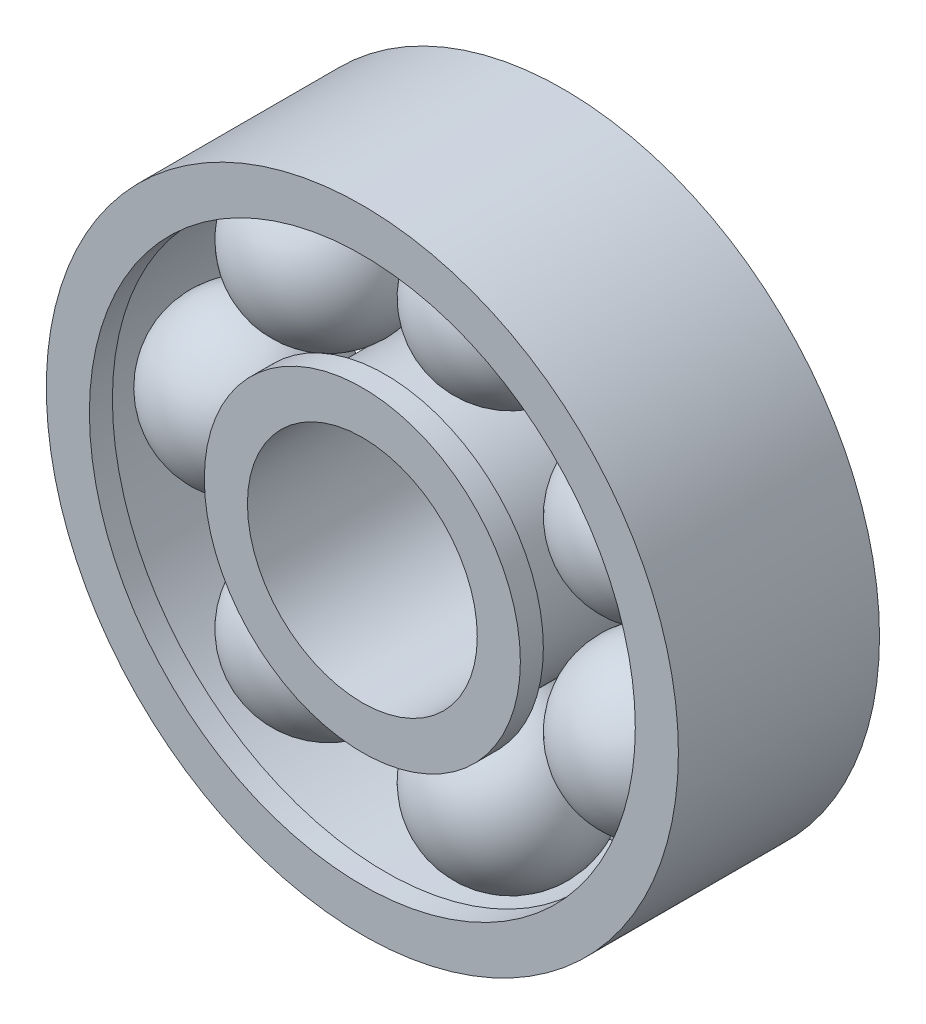
ISO-10303-21;
HEADER;
FILE_DESCRIPTION(('STEP AP214'),'2;1');
FILE_NAME('part.step','',(''),(''),'','','');
FILE_SCHEMA(('AUTOMOTIVE_DESIGN { 1 0 10303 214 1 1 1 1 }'));
ENDSEC;
DATA;
#1=APPLICATION_CONTEXT('core data for automotive mechanical design processes');
#2=APPLICATION_PROTOCOL_DEFINITION('international standard','automotive_design',2000,#1);
#3=PRODUCT_CONTEXT('',#1,'mechanical');
#4=PRODUCT('Part','Part','',(#3));
#5=PRODUCT_RELATED_PRODUCT_CATEGORY('part','',(#4));
#6=PRODUCT_DEFINITION_FORMATION('','',#4);
#7=PRODUCT_DEFINITION_CONTEXT('part definition',#1,'design');
#8=PRODUCT_DEFINITION('design','',#6,#7);
#9=PRODUCT_DEFINITION_SHAPE('','',#8);
#10=(LENGTH_UNIT() NAMED_UNIT(*) SI_UNIT(.MILLI.,.METRE.));
#11=(NAMED_UNIT(*) PLANE_ANGLE_UNIT() SI_UNIT($,.RADIAN.));
#12=(NAMED_UNIT(*) SI_UNIT($,.STERADIAN.) SOLID_ANGLE_UNIT());
#13=UNCERTAINTY_MEASURE_WITH_UNIT(LENGTH_MEASURE(1.E-05),#10,'distance_accuracy_value','');
#14=(GEOMETRIC_REPRESENTATION_CONTEXT(3) GLOBAL_UNCERTAINTY_ASSIGNED_CONTEXT((#13)) GLOBAL_UNIT_ASSIGNED_CONTEXT((#10,
#11,#12)) REPRESENTATION_CONTEXT('',''));
#15=CARTESIAN_POINT('',(0.,0.,0.));
#16=DIRECTION('',(0.,0.,1.));
#17=DIRECTION('',(1.,0.,0.));
#18=AXIS2_PLACEMENT_3D('',#15,#16,#17);
#19=CARTESIAN_POINT('',(-4.67544816414225,-5.86282655863214,0.));
#20=DIRECTION('',(0.781831482468023,-0.623489801858743,0.));
#21=DIRECTION('',(-0.623489801858743,-0.781831482468023,0.));
#22=AXIS2_PLACEMENT_3D('',#19,#20,#21);
#23=SPHERICAL_SURFACE('',#22,2.8);
#24=CARTESIAN_POINT('',(-2.48632001323179,-7.60859800383661,0.));
#25=VERTEX_POINT('',#24);
#26=VERTEX_LOOP('',#25);
#27=FACE_BOUND('',#26,.T.);
#28=ADVANCED_FACE('F56',(#27),#23,.T.);
#29=CLOSED_SHELL('',(#28));
#30=MANIFOLD_SOLID_BREP('B2',#29);
#31=CARTESIAN_POINT('',(1.66864813032649,-7.31082513874743,0.));
#32=DIRECTION('',(-0.974927912181826,-0.222520933956304,0.));
#33=DIRECTION('',(0.222520933956304,-0.974927912181826,0.));
#34=AXIS2_PLACEMENT_3D('',#31,#32,#33);
#35=SPHERICAL_SURFACE('',#34,2.8);
#36=CARTESIAN_POINT('',(-1.06115002378262,-7.93388375382508,0.));
#37=VERTEX_POINT('',#36);
#38=VERTEX_LOOP('',#37);
#39=FACE_BOUND('',#38,.T.);
#40=ADVANCED_FACE('F75',(#39),#35,.T.);
#41=CLOSED_SHELL('',(#40));
#42=MANIFOLD_SOLID_BREP('B7',#41);
#43=CARTESIAN_POINT('',(6.75621834844066,-3.25362327573081,0.));
#44=DIRECTION('',(-0.433883739117566,-0.900968867902415,0.));
#45=DIRECTION('',(-0.900968867902415,0.433883739117566,0.));
#46=AXIS2_PLACEMENT_3D('',#43,#44,#45);
#47=SPHERICAL_SURFACE('',#46,2.8);
#48=CARTESIAN_POINT('',(5.54134387891147,-5.77633610585757,0.));
#49=VERTEX_POINT('',#48);
#50=VERTEX_LOOP('',#49);
#51=FACE_BOUND('',#50,.T.);
#52=ADVANCED_FACE('F94',(#51),#47,.T.);
#53=CLOSED_SHELL('',(#52));
#54=MANIFOLD_SOLID_BREP('B52',#53);
#55=CARTESIAN_POINT('',(6.7562183484407,3.25362327573071,0.));
#56=DIRECTION('',(0.433883739117552,-0.900968867902422,0.));
#57=DIRECTION('',(0.900968867902422,0.433883739117552,0.));
#58=AXIS2_PLACEMENT_3D('',#55,#56,#57);
#59=SPHERICAL_SURFACE('',#58,2.8);
#60=CARTESIAN_POINT('',(7.97109281796985,0.73091044560393,0.));
#61=VERTEX_POINT('',#60);
#62=VERTEX_LOOP('',#61);
#63=FACE_BOUND('',#62,.T.);
#64=ADVANCED_FACE('F113',(#63),#59,.T.);
#65=CLOSED_SHELL('',(#64));
#66=MANIFOLD_SOLID_BREP('B71',#65);
#67=CARTESIAN_POINT('',(1.66864813032659,7.31082513874741,0.));
#68=DIRECTION('',(-0.974927912181823,0.222520933956318,0.));
#69=DIRECTION('',(0.222520933956318,0.974927912181823,0.));
#70=AXIS2_PLACEMENT_3D('',#67,#68,#69);
#71=SPHERICAL_SURFACE('',#70,2.8);
#72=CARTESIAN_POINT('',(-1.06115002378252,7.9338837538251,0.));
#73=VERTEX_POINT('',#72);
#74=VERTEX_LOOP('',#73);
#75=FACE_BOUND('',#74,.T.);
#76=ADVANCED_FACE('F132',(#75),#71,.T.);
#77=CLOSED_SHELL('',(#76));
#78=MANIFOLD_SOLID_BREP('B90',#77);
#79=CARTESIAN_POINT('',(-4.67544816414217,5.8628265586322,0.));
#80=DIRECTION('',(-0.78183148246803,-0.623489801858733,0.));
#81=DIRECTION('',(-0.623489801858733,0.78183148246803,0.));
#82=AXIS2_PLACEMENT_3D('',#79,#80,#81);
#83=SPHERICAL_SURFACE('',#82,2.8);
#84=CARTESIAN_POINT('',(-6.86457631505265,4.11705511342775,0.));
#85=VERTEX_POINT('',#84);
#86=VERTEX_LOOP('',#85);
#87=FACE_BOUND('',#86,.T.);
#88=ADVANCED_FACE('F151',(#87),#83,.T.);
#89=CLOSED_SHELL('',(#88));
#90=MANIFOLD_SOLID_BREP('B109',#89);
#91=CARTESIAN_POINT('',(-7.49883662925013,0.,0.));
#92=DIRECTION('',(0.,-1.,0.));
#93=DIRECTION('',(-1.,0.,0.));
#94=AXIS2_PLACEMENT_3D('',#91,#92,#93);
#95=SPHERICAL_SURFACE('',#94,2.8);
#96=CARTESIAN_POINT('',(-7.49883662925013,-2.8,0.));
#97=VERTEX_POINT('',#96);
#98=VERTEX_LOOP('',#97);
#99=FACE_BOUND('',#98,.T.);
#100=ADVANCED_FACE('F172',(#99),#95,.T.);
#101=CLOSED_SHELL('',(#100));
#102=MANIFOLD_SOLID_BREP('B128',#101);
#103=CARTESIAN_POINT('',(0.,0.,-3.5));
#104=DIRECTION('',(0.,0.,1.));
#105=DIRECTION('',(1.,0.,0.));
#106=AXIS2_PLACEMENT_3D('',#103,#104,#105);
#107=CYLINDRICAL_SURFACE('',#106,5.5);
#108=CARTESIAN_POINT('',(0.,0.,-3.5));
#109=DIRECTION('',(0.,0.,1.));
#110=DIRECTION('',(1.,0.,0.));
#111=AXIS2_PLACEMENT_3D('',#108,#109,#110);
#112=CIRCLE('',#111,5.5);
#113=CARTESIAN_POINT('',(5.5,0.,-3.5));
#114=VERTEX_POINT('',#113);
#115=EDGE_CURVE('E171',#114,#114,#112,.T.);
#116=ORIENTED_EDGE('',*,*,#115,.T.);
#117=EDGE_LOOP('',(#116));
#118=FACE_BOUND('',#117,.T.);
#119=CARTESIAN_POINT('',(0.,0.,-2.7));
#120=DIRECTION('',(0.,0.,1.));
#121=DIRECTION('',(1.,0.,0.));
#122=AXIS2_PLACEMENT_3D('',#119,#120,#121);
#123=CIRCLE('',#122,5.5);
#124=CARTESIAN_POINT('',(5.5,0.,-2.7));
#125=VERTEX_POINT('',#124);
#126=EDGE_CURVE('E208',#125,#125,#123,.F.);
#127=ORIENTED_EDGE('',*,*,#126,.T.);
#128=EDGE_LOOP('',(#127));
#129=FACE_BOUND('',#128,.T.);
#130=ADVANCED_FACE('F192',(#118,#129),#107,.T.);
#131=CARTESIAN_POINT('',(0.,0.,-3.5));
#132=DIRECTION('',(0.,0.,1.));
#133=DIRECTION('',(1.,0.,0.));
#134=AXIS2_PLACEMENT_3D('',#131,#132,#133);
#135=CYLINDRICAL_SURFACE('',#134,4.);
#136=CARTESIAN_POINT('',(0.,0.,-3.5));
#137=DIRECTION('',(0.,0.,1.));
#138=DIRECTION('',(1.,0.,0.));
#139=AXIS2_PLACEMENT_3D('',#136,#137,#138);
#140=CIRCLE('',#139,4.);
#141=CARTESIAN_POINT('',(4.,0.,-3.5));
#142=VERTEX_POINT('',#141);
#143=EDGE_CURVE('E200',#142,#142,#140,.T.);
#144=ORIENTED_EDGE('',*,*,#143,.F.);
#145=EDGE_LOOP('',(#144));
#146=FACE_BOUND('',#145,.T.);
#147=CARTESIAN_POINT('',(0.,0.,3.5));
#148=DIRECTION('',(0.,0.,1.));
#149=DIRECTION('',(1.,0.,0.));
#150=AXIS2_PLACEMENT_3D('',#147,#148,#149);
#151=CIRCLE('',#150,4.);
#152=CARTESIAN_POINT('',(4.,0.,3.5));
#153=VERTEX_POINT('',#152);
#154=EDGE_CURVE('E214',#153,#153,#151,.T.);
#155=ORIENTED_EDGE('',*,*,#154,.T.);
#156=EDGE_LOOP('',(#155));
#157=FACE_BOUND('',#156,.T.);
#158=ADVANCED_FACE('F194',(#146,#157),#135,.F.);
#159=CARTESIAN_POINT('',(0.,0.,2.7));
#160=DIRECTION('',(0.,0.,1.));
#161=DIRECTION('',(1.,0.,0.));
#162=AXIS2_PLACEMENT_3D('',#159,#160,#161);
#163=CIRCLE('',#162,5.5);
#164=CARTESIAN_POINT('',(5.5,0.,2.7));
#165=VERTEX_POINT('',#164);
#166=EDGE_CURVE('E196',#165,#165,#163,.F.);
#167=ORIENTED_EDGE('',*,*,#166,.F.);
#168=EDGE_LOOP('',(#167));
#169=FACE_BOUND('',#168,.T.);
#170=CARTESIAN_POINT('',(0.,0.,3.5));
#171=DIRECTION('',(0.,0.,1.));
#172=DIRECTION('',(1.,0.,0.));
#173=AXIS2_PLACEMENT_3D('',#170,#171,#172);
#174=CIRCLE('',#173,5.5);
#175=CARTESIAN_POINT('',(5.5,0.,3.5));
#176=VERTEX_POINT('',#175);
#177=EDGE_CURVE('E205',#176,#176,#174,.T.);
#178=ORIENTED_EDGE('',*,*,#177,.F.);
#179=EDGE_LOOP('',(#178));
#180=FACE_BOUND('',#179,.T.);
#181=ADVANCED_FACE('F229',(#169,#180),#107,.T.);
#182=CARTESIAN_POINT('',(0.,0.,-3.5));
#183=DIRECTION('',(0.,0.,1.));
#184=DIRECTION('',(1.,0.,0.));
#185=AXIS2_PLACEMENT_3D('',#182,#183,#184);
#186=PLANE('',#185);
#187=ORIENTED_EDGE('',*,*,#143,.T.);
#188=EDGE_LOOP('',(#187));
#189=FACE_BOUND('',#188,.T.);
#190=ORIENTED_EDGE('',*,*,#115,.F.);
#191=EDGE_LOOP('',(#190));
#192=FACE_BOUND('',#191,.T.);
#193=ADVANCED_FACE('F231',(#189,#192),#186,.F.);
#194=CARTESIAN_POINT('',(0.,0.,3.5));
#195=DIRECTION('',(0.,0.,1.));
#196=DIRECTION('',(1.,0.,0.));
#197=AXIS2_PLACEMENT_3D('',#194,#195,#196);
#198=PLANE('',#197);
#199=ORIENTED_EDGE('',*,*,#154,.F.);
#200=EDGE_LOOP('',(#199));
#201=FACE_BOUND('',#200,.T.);
#202=ORIENTED_EDGE('',*,*,#177,.T.);
#203=EDGE_LOOP('',(#202));
#204=FACE_BOUND('',#203,.T.);
#205=ADVANCED_FACE('F227',(#201,#204),#198,.T.);
#206=CARTESIAN_POINT('',(0.,0.,2.7));
#207=DIRECTION('',(0.,0.,1.));
#208=DIRECTION('',(1.,0.,0.));
#209=AXIS2_PLACEMENT_3D('',#206,#207,#208);
#210=PLANE('',#209);
#211=ORIENTED_EDGE('',*,*,#166,.T.);
#212=EDGE_LOOP('',(#211));
#213=FACE_BOUND('',#212,.T.);
#214=CARTESIAN_POINT('',(0.,0.,2.7));
#215=DIRECTION('',(0.,0.,1.));
#216=DIRECTION('',(1.,0.,0.));
#217=AXIS2_PLACEMENT_3D('',#214,#215,#216);
#218=CIRCLE('',#217,4.69767325850026);
#219=CARTESIAN_POINT('',(4.69767325850026,0.,2.7));
#220=VERTEX_POINT('',#219);
#221=EDGE_CURVE('E210',#220,#220,#218,.T.);
#222=ORIENTED_EDGE('',*,*,#221,.T.);
#223=EDGE_LOOP('',(#222));
#224=FACE_BOUND('',#223,.T.);
#225=ADVANCED_FACE('F252',(#213,#224),#210,.F.);
#226=CARTESIAN_POINT('',(0.,0.,2.7));
#227=DIRECTION('',(0.,0.,-1.));
#228=DIRECTION('',(-1.,0.,0.));
#229=AXIS2_PLACEMENT_3D('',#226,#227,#228);
#230=CYLINDRICAL_SURFACE('',#229,4.69767325850026);
#231=ORIENTED_EDGE('',*,*,#221,.F.);
#232=EDGE_LOOP('',(#231));
#233=FACE_BOUND('',#232,.T.);
#234=CARTESIAN_POINT('',(0.,0.,-2.7));
#235=DIRECTION('',(0.,0.,1.));
#236=DIRECTION('',(1.,0.,0.));
#237=AXIS2_PLACEMENT_3D('',#234,#235,#236);
#238=CIRCLE('',#237,4.69767325850026);
#239=CARTESIAN_POINT('',(4.69767325850026,0.,-2.7));
#240=VERTEX_POINT('',#239);
#241=EDGE_CURVE('E216',#240,#240,#238,.T.);
#242=ORIENTED_EDGE('',*,*,#241,.T.);
#243=EDGE_LOOP('',(#242));
#244=FACE_BOUND('',#243,.T.);
#245=ADVANCED_FACE('F280',(#233,#244),#230,.T.);
#246=CARTESIAN_POINT('',(0.,0.,-2.7));
#247=DIRECTION('',(0.,0.,1.));
#248=DIRECTION('',(1.,0.,0.));
#249=AXIS2_PLACEMENT_3D('',#246,#247,#248);
#250=PLANE('',#249);
#251=ORIENTED_EDGE('',*,*,#126,.F.);
#252=EDGE_LOOP('',(#251));
#253=FACE_BOUND('',#252,.T.);
#254=ORIENTED_EDGE('',*,*,#241,.F.);
#255=EDGE_LOOP('',(#254));
#256=FACE_BOUND('',#255,.T.);
#257=ADVANCED_FACE('F290',(#253,#256),#250,.T.);
#258=CLOSED_SHELL('',(#130,#158,#181,#193,#205,#225,#245,#257));
#259=MANIFOLD_SOLID_BREP('B147',#258);
#260=CARTESIAN_POINT('',(0.,0.,-3.5));
#261=DIRECTION('',(0.,0.,1.));
#262=DIRECTION('',(1.,0.,0.));
#263=AXIS2_PLACEMENT_3D('',#260,#261,#262);
#264=CYLINDRICAL_SURFACE('',#263,9.5);
#265=CARTESIAN_POINT('',(0.,0.,-3.5));
#266=DIRECTION('',(0.,0.,1.));
#267=DIRECTION('',(1.,0.,0.));
#268=AXIS2_PLACEMENT_3D('',#265,#266,#267);
#269=CIRCLE('',#268,9.5);
#270=CARTESIAN_POINT('',(9.5,0.,-3.5));
#271=VERTEX_POINT('',#270);
#272=EDGE_CURVE('E321',#271,#271,#269,.T.);
#273=ORIENTED_EDGE('',*,*,#272,.F.);
#274=EDGE_LOOP('',(#273));
#275=FACE_BOUND('',#274,.T.);
#276=CARTESIAN_POINT('',(0.,0.,-2.7));
#277=DIRECTION('',(0.,0.,1.));
#278=DIRECTION('',(1.,0.,0.));
#279=AXIS2_PLACEMENT_3D('',#276,#277,#278);
#280=CIRCLE('',#279,9.5);
#281=CARTESIAN_POINT('',(9.5,0.,-2.7));
#282=VERTEX_POINT('',#281);
#283=EDGE_CURVE('E329',#282,#282,#280,.F.);
#284=ORIENTED_EDGE('',*,*,#283,.F.);
#285=EDGE_LOOP('',(#284));
#286=FACE_BOUND('',#285,.T.);
#287=ADVANCED_FACE('F313',(#275,#286),#264,.F.);
#288=CARTESIAN_POINT('',(0.,0.,2.7));
#289=DIRECTION('',(0.,0.,1.));
#290=DIRECTION('',(1.,0.,0.));
#291=AXIS2_PLACEMENT_3D('',#288,#289,#290);
#292=CIRCLE('',#291,9.5);
#293=CARTESIAN_POINT('',(9.5,0.,2.7));
#294=VERTEX_POINT('',#293);
#295=EDGE_CURVE('E317',#294,#294,#292,.F.);
#296=ORIENTED_EDGE('',*,*,#295,.T.);
#297=EDGE_LOOP('',(#296));
#298=FACE_BOUND('',#297,.T.);
#299=CARTESIAN_POINT('',(0.,0.,3.5));
#300=DIRECTION('',(0.,0.,1.));
#301=DIRECTION('',(1.,0.,0.));
#302=AXIS2_PLACEMENT_3D('',#299,#300,#301);
#303=CIRCLE('',#302,9.5);
#304=CARTESIAN_POINT('',(9.5,0.,3.5));
#305=VERTEX_POINT('',#304);
#306=EDGE_CURVE('E335',#305,#305,#303,.T.);
#307=ORIENTED_EDGE('',*,*,#306,.T.);
#308=EDGE_LOOP('',(#307));
#309=FACE_BOUND('',#308,.T.);
#310=ADVANCED_FACE('F315',(#298,#309),#264,.F.);
#311=CARTESIAN_POINT('',(0.,0.,-3.5));
#312=DIRECTION('',(0.,0.,1.));
#313=DIRECTION('',(1.,0.,0.));
#314=AXIS2_PLACEMENT_3D('',#311,#312,#313);
#315=CYLINDRICAL_SURFACE('',#314,11.);
#316=CARTESIAN_POINT('',(0.,0.,-3.5));
#317=DIRECTION('',(0.,0.,1.));
#318=DIRECTION('',(1.,0.,0.));
#319=AXIS2_PLACEMENT_3D('',#316,#317,#318);
#320=CIRCLE('',#319,11.);
#321=CARTESIAN_POINT('',(11.,0.,-3.5));
#322=VERTEX_POINT('',#321);
#323=EDGE_CURVE('E191',#322,#322,#320,.T.);
#324=ORIENTED_EDGE('',*,*,#323,.T.);
#325=EDGE_LOOP('',(#324));
#326=FACE_BOUND('',#325,.T.);
#327=CARTESIAN_POINT('',(0.,0.,3.5));
#328=DIRECTION('',(0.,0.,1.));
#329=DIRECTION('',(1.,0.,0.));
#330=AXIS2_PLACEMENT_3D('',#327,#328,#329);
#331=CIRCLE('',#330,11.);
#332=CARTESIAN_POINT('',(11.,0.,3.5));
#333=VERTEX_POINT('',#332);
#334=EDGE_CURVE('E326',#333,#333,#331,.T.);
#335=ORIENTED_EDGE('',*,*,#334,.F.);
#336=EDGE_LOOP('',(#335));
#337=FACE_BOUND('',#336,.T.);
#338=ADVANCED_FACE('F350',(#326,#337),#315,.T.);
#339=CARTESIAN_POINT('',(0.,0.,-3.5));
#340=DIRECTION('',(0.,0.,1.));
#341=DIRECTION('',(1.,0.,0.));
#342=AXIS2_PLACEMENT_3D('',#339,#340,#341);
#343=PLANE('',#342);
#344=ORIENTED_EDGE('',*,*,#272,.T.);
#345=EDGE_LOOP('',(#344));
#346=FACE_BOUND('',#345,.T.);
#347=ORIENTED_EDGE('',*,*,#323,.F.);
#348=EDGE_LOOP('',(#347));
#349=FACE_BOUND('',#348,.T.);
#350=ADVANCED_FACE('F352',(#346,#349),#343,.F.);
#351=CARTESIAN_POINT('',(0.,0.,3.5));
#352=DIRECTION('',(0.,0.,1.));
#353=DIRECTION('',(1.,0.,0.));
#354=AXIS2_PLACEMENT_3D('',#351,#352,#353);
#355=PLANE('',#354);
#356=ORIENTED_EDGE('',*,*,#306,.F.);
#357=EDGE_LOOP('',(#356));
#358=FACE_BOUND('',#357,.T.);
#359=ORIENTED_EDGE('',*,*,#334,.T.);
#360=EDGE_LOOP('',(#359));
#361=FACE_BOUND('',#360,.T.);
#362=ADVANCED_FACE('F348',(#358,#361),#355,.T.);
#363=CARTESIAN_POINT('',(0.,0.,2.7));
#364=DIRECTION('',(0.,0.,1.));
#365=DIRECTION('',(1.,0.,0.));
#366=AXIS2_PLACEMENT_3D('',#363,#364,#365);
#367=PLANE('',#366);
#368=CARTESIAN_POINT('',(0.,0.,2.7));
#369=DIRECTION('',(0.,0.,1.));
#370=DIRECTION('',(1.,0.,0.));
#371=AXIS2_PLACEMENT_3D('',#368,#369,#370);
#372=CIRCLE('',#371,10.3);
#373=CARTESIAN_POINT('',(10.3,0.,2.7));
#374=VERTEX_POINT('',#373);
#375=EDGE_CURVE('E331',#374,#374,#372,.T.);
#376=ORIENTED_EDGE('',*,*,#375,.F.);
#377=EDGE_LOOP('',(#376));
#378=FACE_BOUND('',#377,.T.);
#379=ORIENTED_EDGE('',*,*,#295,.F.);
#380=EDGE_LOOP('',(#379));
#381=FACE_BOUND('',#380,.T.);
#382=ADVANCED_FACE('F380',(#378,#381),#367,.F.);
#383=CARTESIAN_POINT('',(0.,0.,-2.7));
#384=DIRECTION('',(0.,0.,1.));
#385=DIRECTION('',(1.,0.,0.));
#386=AXIS2_PLACEMENT_3D('',#383,#384,#385);
#387=PLANE('',#386);
#388=CARTESIAN_POINT('',(0.,0.,-2.7));
#389=DIRECTION('',(0.,0.,1.));
#390=DIRECTION('',(1.,0.,0.));
#391=AXIS2_PLACEMENT_3D('',#388,#389,#390);
#392=CIRCLE('',#391,10.3);
#393=CARTESIAN_POINT('',(10.3,0.,-2.7));
#394=VERTEX_POINT('',#393);
#395=EDGE_CURVE('E337',#394,#394,#392,.T.);
#396=ORIENTED_EDGE('',*,*,#395,.T.);
#397=EDGE_LOOP('',(#396));
#398=FACE_BOUND('',#397,.T.);
#399=ORIENTED_EDGE('',*,*,#283,.T.);
#400=EDGE_LOOP('',(#399));
#401=FACE_BOUND('',#400,.T.);
#402=ADVANCED_FACE('F384',(#398,#401),#387,.T.);
#403=CARTESIAN_POINT('',(0.,0.,2.7));
#404=DIRECTION('',(0.,0.,-1.));
#405=DIRECTION('',(-1.,0.,0.));
#406=AXIS2_PLACEMENT_3D('',#403,#404,#405);
#407=CYLINDRICAL_SURFACE('',#406,10.3);
#408=ORIENTED_EDGE('',*,*,#375,.T.);
#409=EDGE_LOOP('',(#408));
#410=FACE_BOUND('',#409,.T.);
#411=ORIENTED_EDGE('',*,*,#395,.F.);
#412=EDGE_LOOP('',(#411));
#413=FACE_BOUND('',#412,.T.);
#414=ADVANCED_FACE('F392',(#410,#413),#407,.F.);
#415=CLOSED_SHELL('',(#287,#310,#338,#350,#362,#382,#402,#414));
#416=MANIFOLD_SOLID_BREP('B166',#415);
#417=ADVANCED_BREP_SHAPE_REPRESENTATION('',(#18,#30,#42,#54,#66,#78,#90,#102,#259,#416),#14);
#418=SHAPE_DEFINITION_REPRESENTATION(#9,#417);
ENDSEC;
END-ISO-10303-21;
